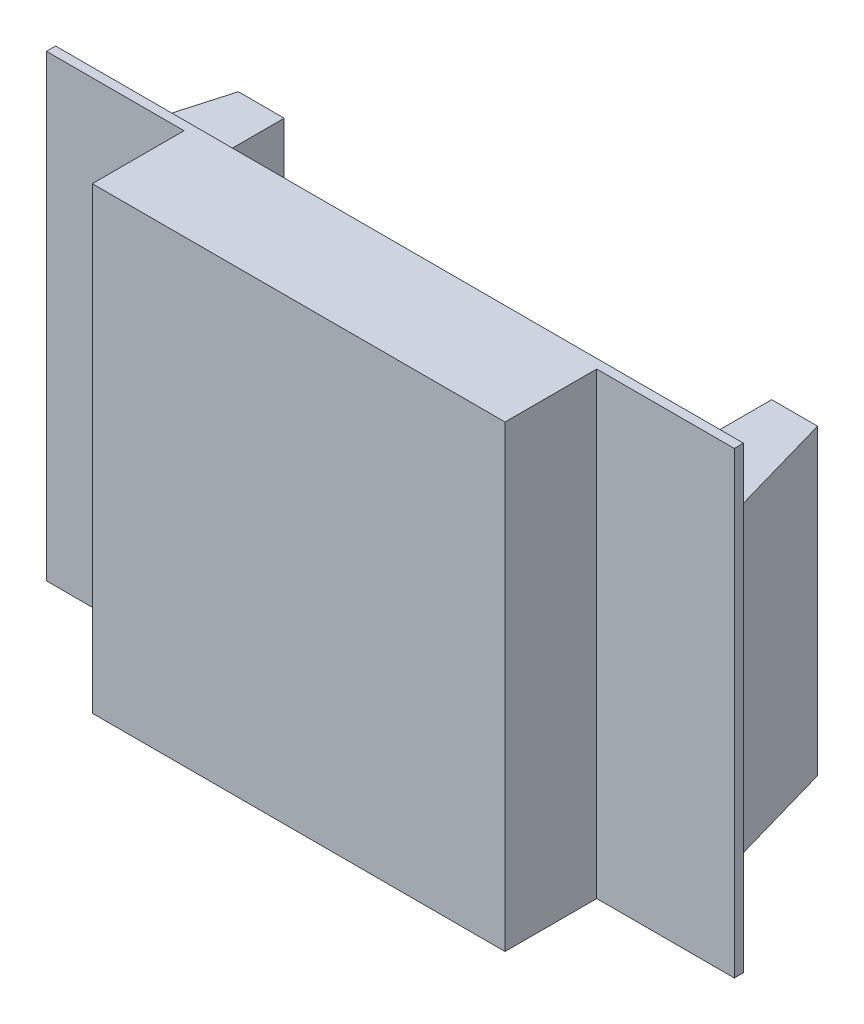
ISO-10303-21;
HEADER;
FILE_DESCRIPTION(('STEP AP214'),'2;1');
FILE_NAME('part.step','',(''),(''),'','','');
FILE_SCHEMA(('AUTOMOTIVE_DESIGN { 1 0 10303 214 1 1 1 1 }'));
ENDSEC;
DATA;
#1=APPLICATION_CONTEXT('core data for automotive mechanical design processes');
#2=APPLICATION_PROTOCOL_DEFINITION('international standard','automotive_design',2000,#1);
#3=PRODUCT_CONTEXT('',#1,'mechanical');
#4=PRODUCT('Part','Part','',(#3));
#5=PRODUCT_RELATED_PRODUCT_CATEGORY('part','',(#4));
#6=PRODUCT_DEFINITION_FORMATION('','',#4);
#7=PRODUCT_DEFINITION_CONTEXT('part definition',#1,'design');
#8=PRODUCT_DEFINITION('design','',#6,#7);
#9=PRODUCT_DEFINITION_SHAPE('','',#8);
#10=(LENGTH_UNIT() NAMED_UNIT(*) SI_UNIT(.MILLI.,.METRE.));
#11=(NAMED_UNIT(*) PLANE_ANGLE_UNIT() SI_UNIT($,.RADIAN.));
#12=(NAMED_UNIT(*) SI_UNIT($,.STERADIAN.) SOLID_ANGLE_UNIT());
#13=UNCERTAINTY_MEASURE_WITH_UNIT(LENGTH_MEASURE(1.E-05),#10,'distance_accuracy_value','');
#14=(GEOMETRIC_REPRESENTATION_CONTEXT(3) GLOBAL_UNCERTAINTY_ASSIGNED_CONTEXT((#13)) GLOBAL_UNIT_ASSIGNED_CONTEXT((#10,
#11,#12)) REPRESENTATION_CONTEXT('',''));
#15=CARTESIAN_POINT('',(0.,0.,0.));
#16=DIRECTION('',(0.,0.,1.));
#17=DIRECTION('',(1.,0.,0.));
#18=AXIS2_PLACEMENT_3D('',#15,#16,#17);
#19=CARTESIAN_POINT('',(0.,0.,1.));
#20=DIRECTION('',(0.,0.,1.));
#21=DIRECTION('',(1.,0.,0.));
#22=AXIS2_PLACEMENT_3D('',#19,#20,#21);
#23=PLANE('',#22);
#24=DIRECTION('',(-1.,0.,0.));
#25=VECTOR('',#24,1.);
#26=CARTESIAN_POINT('',(-42.4202127659574,41.3563829787234,1.));
#27=LINE('',#26,#25);
#28=CARTESIAN_POINT('',(32.5797872340425,41.3563829787234,1.));
#29=VERTEX_POINT('',#28);
#30=CARTESIAN_POINT('',(17.5797872340425,41.3563829787234,1.));
#31=VERTEX_POINT('',#30);
#32=EDGE_CURVE('E248',#29,#31,#27,.T.);
#33=ORIENTED_EDGE('',*,*,#32,.T.);
#34=DIRECTION('',(0.,-1.,0.));
#35=VECTOR('',#34,1.);
#36=CARTESIAN_POINT('',(17.5797872340425,87.4541052651878,1.));
#37=LINE('',#36,#35);
#38=CARTESIAN_POINT('',(17.5797872340425,-8.6436170212766,1.));
#39=VERTEX_POINT('',#38);
#40=EDGE_CURVE('E231',#31,#39,#37,.T.);
#41=ORIENTED_EDGE('',*,*,#40,.T.);
#42=DIRECTION('',(1.,0.,0.));
#43=VECTOR('',#42,1.);
#44=CARTESIAN_POINT('',(-42.4202127659574,-8.6436170212766,1.));
#45=LINE('',#44,#43);
#46=CARTESIAN_POINT('',(32.5797872340426,-8.6436170212766,1.));
#47=VERTEX_POINT('',#46);
#48=EDGE_CURVE('E240',#39,#47,#45,.T.);
#49=ORIENTED_EDGE('',*,*,#48,.T.);
#50=DIRECTION('',(0.,1.,0.));
#51=VECTOR('',#50,1.);
#52=CARTESIAN_POINT('',(32.5797872340425,41.3563829787234,1.));
#53=LINE('',#52,#51);
#54=EDGE_CURVE('E245',#47,#29,#53,.T.);
#55=ORIENTED_EDGE('',*,*,#54,.T.);
#56=EDGE_LOOP('',(#33,#41,#49,#55));
#57=FACE_BOUND('',#56,.T.);
#58=ADVANCED_FACE('F34',(#57),#23,.T.);
#59=CARTESIAN_POINT('',(-42.4202127659574,41.3563829787234,1.));
#60=DIRECTION('',(1.,0.,0.));
#61=DIRECTION('',(0.,0.,-1.));
#62=AXIS2_PLACEMENT_3D('',#59,#60,#61);
#63=PLANE('',#62);
#64=DIRECTION('',(0.,-1.,0.));
#65=VECTOR('',#64,1.);
#66=CARTESIAN_POINT('',(-42.4202127659574,41.3563829787234,0.));
#67=LINE('',#66,#65);
#68=CARTESIAN_POINT('',(-42.4202127659574,41.3563829787234,0.));
#69=VERTEX_POINT('',#68);
#70=CARTESIAN_POINT('',(-42.4202127659574,-8.6436170212766,0.));
#71=VERTEX_POINT('',#70);
#72=EDGE_CURVE('E229',#69,#71,#67,.T.);
#73=ORIENTED_EDGE('',*,*,#72,.T.);
#74=DIRECTION('',(0.,0.,-1.));
#75=VECTOR('',#74,1.);
#76=CARTESIAN_POINT('',(-42.4202127659574,-8.6436170212766,1.));
#77=LINE('',#76,#75);
#78=CARTESIAN_POINT('',(-42.4202127659574,-8.6436170212766,1.));
#79=VERTEX_POINT('',#78);
#80=EDGE_CURVE('E11',#79,#71,#77,.T.);
#81=ORIENTED_EDGE('',*,*,#80,.F.);
#82=DIRECTION('',(0.,-1.,0.));
#83=VECTOR('',#82,1.);
#84=CARTESIAN_POINT('',(-42.4202127659574,41.3563829787234,1.));
#85=LINE('',#84,#83);
#86=CARTESIAN_POINT('',(-42.4202127659574,41.3563829787234,1.));
#87=VERTEX_POINT('',#86);
#88=EDGE_CURVE('E237',#87,#79,#85,.T.);
#89=ORIENTED_EDGE('',*,*,#88,.F.);
#90=DIRECTION('',(0.,0.,-1.));
#91=VECTOR('',#90,1.);
#92=CARTESIAN_POINT('',(-42.4202127659574,41.3563829787234,1.));
#93=LINE('',#92,#91);
#94=EDGE_CURVE('E251',#87,#69,#93,.T.);
#95=ORIENTED_EDGE('',*,*,#94,.T.);
#96=EDGE_LOOP('',(#73,#81,#89,#95));
#97=FACE_BOUND('',#96,.T.);
#98=ADVANCED_FACE('F36',(#97),#63,.F.);
#99=CARTESIAN_POINT('',(-42.4202127659574,-8.6436170212766,1.));
#100=DIRECTION('',(0.,1.,0.));
#101=DIRECTION('',(0.,0.,1.));
#102=AXIS2_PLACEMENT_3D('',#99,#100,#101);
#103=PLANE('',#102);
#104=DIRECTION('',(1.,0.,0.));
#105=VECTOR('',#104,1.);
#106=CARTESIAN_POINT('',(-42.4202127659574,-8.6436170212766,0.));
#107=LINE('',#106,#105);
#108=CARTESIAN_POINT('',(32.5797872340426,-8.6436170212766,0.));
#109=VERTEX_POINT('',#108);
#110=EDGE_CURVE('E254',#71,#109,#107,.T.);
#111=ORIENTED_EDGE('',*,*,#110,.T.);
#112=DIRECTION('',(0.,0.,-1.));
#113=VECTOR('',#112,1.);
#114=CARTESIAN_POINT('',(32.5797872340426,-8.6436170212766,1.));
#115=LINE('',#114,#113);
#116=EDGE_CURVE('E42',#47,#109,#115,.T.);
#117=ORIENTED_EDGE('',*,*,#116,.F.);
#118=ORIENTED_EDGE('',*,*,#48,.F.);
#119=DIRECTION('',(0.,0.,1.));
#120=VECTOR('',#119,1.);
#121=CARTESIAN_POINT('',(17.5797872340425,-8.6436170212766,1.));
#122=LINE('',#121,#120);
#123=CARTESIAN_POINT('',(17.5797872340425,-8.6436170212766,11.));
#124=VERTEX_POINT('',#123);
#125=EDGE_CURVE('E210',#39,#124,#122,.T.);
#126=ORIENTED_EDGE('',*,*,#125,.T.);
#127=DIRECTION('',(-1.,0.,0.));
#128=VECTOR('',#127,1.);
#129=CARTESIAN_POINT('',(-27.4202127659574,-8.6436170212766,11.));
#130=LINE('',#129,#128);
#131=CARTESIAN_POINT('',(-27.4202127659574,-8.6436170212766,11.));
#132=VERTEX_POINT('',#131);
#133=EDGE_CURVE('E216',#124,#132,#130,.T.);
#134=ORIENTED_EDGE('',*,*,#133,.T.);
#135=DIRECTION('',(0.,0.,-1.));
#136=VECTOR('',#135,1.);
#137=CARTESIAN_POINT('',(-27.4202127659574,-8.6436170212766,1.));
#138=LINE('',#137,#136);
#139=CARTESIAN_POINT('',(-27.4202127659574,-8.6436170212766,1.));
#140=VERTEX_POINT('',#139);
#141=EDGE_CURVE('E213',#132,#140,#138,.T.);
#142=ORIENTED_EDGE('',*,*,#141,.T.);
#143=EDGE_CURVE('E242',#79,#140,#45,.T.);
#144=ORIENTED_EDGE('',*,*,#143,.F.);
#145=ORIENTED_EDGE('',*,*,#80,.T.);
#146=EDGE_LOOP('',(#111,#117,#118,#126,#134,#142,#144,#145));
#147=FACE_BOUND('',#146,.T.);
#148=ADVANCED_FACE('F299',(#147),#103,.F.);
#149=CARTESIAN_POINT('',(32.5797872340425,41.3563829787234,1.));
#150=DIRECTION('',(-1.,0.,0.));
#151=DIRECTION('',(0.,-1.,0.));
#152=AXIS2_PLACEMENT_3D('',#149,#150,#151);
#153=PLANE('',#152);
#154=DIRECTION('',(0.,1.,0.));
#155=VECTOR('',#154,1.);
#156=CARTESIAN_POINT('',(32.5797872340425,41.3563829787234,0.));
#157=LINE('',#156,#155);
#158=CARTESIAN_POINT('',(32.5797872340425,41.3563829787234,0.));
#159=VERTEX_POINT('',#158);
#160=EDGE_CURVE('E256',#109,#159,#157,.T.);
#161=ORIENTED_EDGE('',*,*,#160,.T.);
#162=DIRECTION('',(0.,0.,-1.));
#163=VECTOR('',#162,1.);
#164=CARTESIAN_POINT('',(32.5797872340425,41.3563829787234,1.));
#165=LINE('',#164,#163);
#166=EDGE_CURVE('E261',#29,#159,#165,.T.);
#167=ORIENTED_EDGE('',*,*,#166,.F.);
#168=ORIENTED_EDGE('',*,*,#54,.F.);
#169=ORIENTED_EDGE('',*,*,#116,.T.);
#170=EDGE_LOOP('',(#161,#167,#168,#169));
#171=FACE_BOUND('',#170,.T.);
#172=ADVANCED_FACE('F268',(#171),#153,.F.);
#173=CARTESIAN_POINT('',(-42.4202127659574,41.3563829787234,1.));
#174=DIRECTION('',(0.,-1.,0.));
#175=DIRECTION('',(0.,0.,-1.));
#176=AXIS2_PLACEMENT_3D('',#173,#174,#175);
#177=PLANE('',#176);
#178=DIRECTION('',(-1.,0.,0.));
#179=VECTOR('',#178,1.);
#180=CARTESIAN_POINT('',(-42.4202127659574,41.3563829787234,0.));
#181=LINE('',#180,#179);
#182=EDGE_CURVE('E241',#159,#69,#181,.T.);
#183=ORIENTED_EDGE('',*,*,#182,.T.);
#184=ORIENTED_EDGE('',*,*,#94,.F.);
#185=CARTESIAN_POINT('',(-27.4202127659574,41.3563829787234,1.));
#186=VERTEX_POINT('',#185);
#187=EDGE_CURVE('E247',#186,#87,#27,.T.);
#188=ORIENTED_EDGE('',*,*,#187,.F.);
#189=DIRECTION('',(0.,0.,-1.));
#190=VECTOR('',#189,1.);
#191=CARTESIAN_POINT('',(-27.4202127659574,41.3563829787234,1.));
#192=LINE('',#191,#190);
#193=CARTESIAN_POINT('',(-27.4202127659574,41.3563829787234,11.));
#194=VERTEX_POINT('',#193);
#195=EDGE_CURVE('E227',#194,#186,#192,.T.);
#196=ORIENTED_EDGE('',*,*,#195,.F.);
#197=DIRECTION('',(-1.,0.,0.));
#198=VECTOR('',#197,1.);
#199=CARTESIAN_POINT('',(-27.4202127659574,41.3563829787234,11.));
#200=LINE('',#199,#198);
#201=CARTESIAN_POINT('',(17.5797872340425,41.3563829787234,11.));
#202=VERTEX_POINT('',#201);
#203=EDGE_CURVE('E223',#202,#194,#200,.T.);
#204=ORIENTED_EDGE('',*,*,#203,.F.);
#205=DIRECTION('',(0.,0.,1.));
#206=VECTOR('',#205,1.);
#207=CARTESIAN_POINT('',(17.5797872340425,41.3563829787234,1.));
#208=LINE('',#207,#206);
#209=EDGE_CURVE('E220',#31,#202,#208,.T.);
#210=ORIENTED_EDGE('',*,*,#209,.F.);
#211=ORIENTED_EDGE('',*,*,#32,.F.);
#212=ORIENTED_EDGE('',*,*,#166,.T.);
#213=EDGE_LOOP('',(#183,#184,#188,#196,#204,#210,#211,#212));
#214=FACE_BOUND('',#213,.T.);
#215=ADVANCED_FACE('F278',(#214),#177,.F.);
#216=DIRECTION('',(0.,-1.,0.));
#217=VECTOR('',#216,1.);
#218=CARTESIAN_POINT('',(-27.4202127659574,87.4541052651878,1.));
#219=LINE('',#218,#217);
#220=EDGE_CURVE('E219',#186,#140,#219,.T.);
#221=ORIENTED_EDGE('',*,*,#220,.F.);
#222=ORIENTED_EDGE('',*,*,#187,.T.);
#223=ORIENTED_EDGE('',*,*,#88,.T.);
#224=ORIENTED_EDGE('',*,*,#143,.T.);
#225=EDGE_LOOP('',(#221,#222,#223,#224));
#226=FACE_BOUND('',#225,.T.);
#227=ADVANCED_FACE('F286',(#226),#23,.T.);
#228=CARTESIAN_POINT('',(0.,0.,0.));
#229=DIRECTION('',(0.,0.,1.));
#230=DIRECTION('',(1.,0.,0.));
#231=AXIS2_PLACEMENT_3D('',#228,#229,#230);
#232=PLANE('',#231);
#233=DIRECTION('',(0.,-1.,0.));
#234=VECTOR('',#233,1.);
#235=CARTESIAN_POINT('',(30.6560744380778,33.,0.));
#236=LINE('',#235,#234);
#237=CARTESIAN_POINT('',(30.6560744380778,33.,0.));
#238=VERTEX_POINT('',#237);
#239=CARTESIAN_POINT('',(30.6560744380778,0.,0.));
#240=VERTEX_POINT('',#239);
#241=EDGE_CURVE('E54',#238,#240,#236,.T.);
#242=ORIENTED_EDGE('',*,*,#241,.F.);
#243=DIRECTION('',(1.,0.,0.));
#244=VECTOR('',#243,1.);
#245=CARTESIAN_POINT('',(21.6560744380778,33.,0.));
#246=LINE('',#245,#244);
#247=CARTESIAN_POINT('',(21.6560744380778,33.,0.));
#248=VERTEX_POINT('',#247);
#249=EDGE_CURVE('E49',#248,#238,#246,.T.);
#250=ORIENTED_EDGE('',*,*,#249,.F.);
#251=DIRECTION('',(0.,-1.,0.));
#252=VECTOR('',#251,1.);
#253=CARTESIAN_POINT('',(21.6560744380778,33.,0.));
#254=LINE('',#253,#252);
#255=CARTESIAN_POINT('',(21.6560744380778,0.,0.));
#256=VERTEX_POINT('',#255);
#257=EDGE_CURVE('E178',#248,#256,#254,.T.);
#258=ORIENTED_EDGE('',*,*,#257,.T.);
#259=DIRECTION('',(1.,0.,0.));
#260=VECTOR('',#259,1.);
#261=CARTESIAN_POINT('',(21.6560744380778,0.,0.));
#262=LINE('',#261,#260);
#263=EDGE_CURVE('E171',#256,#240,#262,.T.);
#264=ORIENTED_EDGE('',*,*,#263,.T.);
#265=EDGE_LOOP('',(#242,#250,#258,#264));
#266=FACE_BOUND('',#265,.T.);
#267=DIRECTION('',(0.,-1.,0.));
#268=VECTOR('',#267,1.);
#269=CARTESIAN_POINT('',(-31.4964999699927,33.,0.));
#270=LINE('',#269,#268);
#271=CARTESIAN_POINT('',(-31.4964999699927,33.,0.));
#272=VERTEX_POINT('',#271);
#273=CARTESIAN_POINT('',(-31.4964999699927,0.,0.));
#274=VERTEX_POINT('',#273);
#275=EDGE_CURVE('E207',#272,#274,#270,.T.);
#276=ORIENTED_EDGE('',*,*,#275,.F.);
#277=DIRECTION('',(1.,0.,0.));
#278=VECTOR('',#277,1.);
#279=CARTESIAN_POINT('',(-31.4964999699927,33.,0.));
#280=LINE('',#279,#278);
#281=CARTESIAN_POINT('',(-40.4964999699927,33.,0.));
#282=VERTEX_POINT('',#281);
#283=EDGE_CURVE('E181',#282,#272,#280,.T.);
#284=ORIENTED_EDGE('',*,*,#283,.F.);
#285=DIRECTION('',(0.,-1.,0.));
#286=VECTOR('',#285,1.);
#287=CARTESIAN_POINT('',(-40.4964999699927,33.,0.));
#288=LINE('',#287,#286);
#289=CARTESIAN_POINT('',(-40.4964999699927,0.,0.));
#290=VERTEX_POINT('',#289);
#291=EDGE_CURVE('E192',#282,#290,#288,.T.);
#292=ORIENTED_EDGE('',*,*,#291,.T.);
#293=DIRECTION('',(1.,0.,0.));
#294=VECTOR('',#293,1.);
#295=CARTESIAN_POINT('',(-31.4964999699927,0.,0.));
#296=LINE('',#295,#294);
#297=EDGE_CURVE('E180',#290,#274,#296,.T.);
#298=ORIENTED_EDGE('',*,*,#297,.T.);
#299=EDGE_LOOP('',(#276,#284,#292,#298));
#300=FACE_BOUND('',#299,.T.);
#301=ORIENTED_EDGE('',*,*,#72,.F.);
#302=ORIENTED_EDGE('',*,*,#182,.F.);
#303=ORIENTED_EDGE('',*,*,#160,.F.);
#304=ORIENTED_EDGE('',*,*,#110,.F.);
#305=EDGE_LOOP('',(#301,#302,#303,#304));
#306=FACE_BOUND('',#305,.T.);
#307=ADVANCED_FACE('F275',(#266,#300,#306),#232,.F.);
#308=CARTESIAN_POINT('',(17.5797872340425,87.4541052651878,1.));
#309=DIRECTION('',(-1.,0.,0.));
#310=DIRECTION('',(0.,0.,1.));
#311=AXIS2_PLACEMENT_3D('',#308,#309,#310);
#312=PLANE('',#311);
#313=ORIENTED_EDGE('',*,*,#40,.F.);
#314=ORIENTED_EDGE('',*,*,#209,.T.);
#315=DIRECTION('',(0.,-1.,0.));
#316=VECTOR('',#315,1.);
#317=CARTESIAN_POINT('',(17.5797872340425,87.4541052651878,11.));
#318=LINE('',#317,#316);
#319=EDGE_CURVE('E234',#202,#124,#318,.T.);
#320=ORIENTED_EDGE('',*,*,#319,.T.);
#321=ORIENTED_EDGE('',*,*,#125,.F.);
#322=EDGE_LOOP('',(#313,#314,#320,#321));
#323=FACE_BOUND('',#322,.T.);
#324=ADVANCED_FACE('F297',(#323),#312,.F.);
#325=CARTESIAN_POINT('',(-27.4202127659574,87.4541052651878,11.));
#326=DIRECTION('',(0.,0.,-1.));
#327=DIRECTION('',(-1.,0.,0.));
#328=AXIS2_PLACEMENT_3D('',#325,#326,#327);
#329=PLANE('',#328);
#330=ORIENTED_EDGE('',*,*,#319,.F.);
#331=ORIENTED_EDGE('',*,*,#203,.T.);
#332=DIRECTION('',(0.,-1.,0.));
#333=VECTOR('',#332,1.);
#334=CARTESIAN_POINT('',(-27.4202127659574,87.4541052651878,11.));
#335=LINE('',#334,#333);
#336=EDGE_CURVE('E224',#194,#132,#335,.T.);
#337=ORIENTED_EDGE('',*,*,#336,.T.);
#338=ORIENTED_EDGE('',*,*,#133,.F.);
#339=EDGE_LOOP('',(#330,#331,#337,#338));
#340=FACE_BOUND('',#339,.T.);
#341=ADVANCED_FACE('F294',(#340),#329,.F.);
#342=CARTESIAN_POINT('',(-27.4202127659574,87.4541052651878,1.));
#343=DIRECTION('',(1.,0.,0.));
#344=DIRECTION('',(0.,0.,-1.));
#345=AXIS2_PLACEMENT_3D('',#342,#343,#344);
#346=PLANE('',#345);
#347=ORIENTED_EDGE('',*,*,#336,.F.);
#348=ORIENTED_EDGE('',*,*,#195,.T.);
#349=ORIENTED_EDGE('',*,*,#220,.T.);
#350=ORIENTED_EDGE('',*,*,#141,.F.);
#351=EDGE_LOOP('',(#347,#348,#349,#350));
#352=FACE_BOUND('',#351,.T.);
#353=ADVANCED_FACE('F291',(#352),#346,.F.);
#354=CARTESIAN_POINT('',(-31.4964999699927,33.,-14.));
#355=DIRECTION('',(-1.,0.,0.));
#356=DIRECTION('',(0.,0.,1.));
#357=AXIS2_PLACEMENT_3D('',#354,#355,#356);
#358=PLANE('',#357);
#359=DIRECTION('',(0.,0.,-1.));
#360=VECTOR('',#359,1.);
#361=CARTESIAN_POINT('',(-31.4964999699927,0.,-14.));
#362=LINE('',#361,#360);
#363=CARTESIAN_POINT('',(-31.4964999699927,0.,-14.));
#364=VERTEX_POINT('',#363);
#365=EDGE_CURVE('E194',#274,#364,#362,.T.);
#366=ORIENTED_EDGE('',*,*,#365,.T.);
#367=DIRECTION('',(0.,-1.,0.));
#368=VECTOR('',#367,1.);
#369=CARTESIAN_POINT('',(-31.4964999699927,33.,-14.));
#370=LINE('',#369,#368);
#371=CARTESIAN_POINT('',(-31.4964999699927,33.,-14.));
#372=VERTEX_POINT('',#371);
#373=EDGE_CURVE('E204',#372,#364,#370,.T.);
#374=ORIENTED_EDGE('',*,*,#373,.F.);
#375=DIRECTION('',(0.,0.,-1.));
#376=VECTOR('',#375,1.);
#377=CARTESIAN_POINT('',(-31.4964999699927,33.,-14.));
#378=LINE('',#377,#376);
#379=EDGE_CURVE('E184',#272,#372,#378,.T.);
#380=ORIENTED_EDGE('',*,*,#379,.F.);
#381=ORIENTED_EDGE('',*,*,#275,.T.);
#382=EDGE_LOOP('',(#366,#374,#380,#381));
#383=FACE_BOUND('',#382,.T.);
#384=ADVANCED_FACE('F379',(#383),#358,.F.);
#385=CARTESIAN_POINT('',(-36.4964999699927,33.,-14.));
#386=DIRECTION('',(0.,0.,1.));
#387=DIRECTION('',(1.,0.,0.));
#388=AXIS2_PLACEMENT_3D('',#385,#386,#387);
#389=PLANE('',#388);
#390=DIRECTION('',(-1.,0.,0.));
#391=VECTOR('',#390,1.);
#392=CARTESIAN_POINT('',(-36.4964999699927,0.,-14.));
#393=LINE('',#392,#391);
#394=CARTESIAN_POINT('',(-36.4964999699927,0.,-14.));
#395=VERTEX_POINT('',#394);
#396=EDGE_CURVE('E196',#364,#395,#393,.T.);
#397=ORIENTED_EDGE('',*,*,#396,.T.);
#398=DIRECTION('',(0.,-1.,0.));
#399=VECTOR('',#398,1.);
#400=CARTESIAN_POINT('',(-36.4964999699927,33.,-14.));
#401=LINE('',#400,#399);
#402=CARTESIAN_POINT('',(-36.4964999699927,33.,-14.));
#403=VERTEX_POINT('',#402);
#404=EDGE_CURVE('E201',#403,#395,#401,.T.);
#405=ORIENTED_EDGE('',*,*,#404,.F.);
#406=DIRECTION('',(-1.,0.,0.));
#407=VECTOR('',#406,1.);
#408=CARTESIAN_POINT('',(-36.4964999699927,33.,-14.));
#409=LINE('',#408,#407);
#410=EDGE_CURVE('E187',#372,#403,#409,.T.);
#411=ORIENTED_EDGE('',*,*,#410,.F.);
#412=ORIENTED_EDGE('',*,*,#373,.T.);
#413=EDGE_LOOP('',(#397,#405,#411,#412));
#414=FACE_BOUND('',#413,.T.);
#415=ADVANCED_FACE('F387',(#414),#389,.F.);
#416=CARTESIAN_POINT('',(-40.4964999699927,33.,0.));
#417=DIRECTION('',(0.961523947640823,0.,0.274721127897378));
#418=DIRECTION('',(0.274721127897378,0.,-0.961523947640823));
#419=AXIS2_PLACEMENT_3D('',#416,#417,#418);
#420=PLANE('',#419);
#421=DIRECTION('',(-0.274721127897378,0.,0.961523947640823));
#422=VECTOR('',#421,1.);
#423=CARTESIAN_POINT('',(-40.4964999699927,0.,0.));
#424=LINE('',#423,#422);
#425=EDGE_CURVE('E185',#395,#290,#424,.T.);
#426=ORIENTED_EDGE('',*,*,#425,.T.);
#427=ORIENTED_EDGE('',*,*,#291,.F.);
#428=DIRECTION('',(-0.274721127897378,0.,0.961523947640823));
#429=VECTOR('',#428,1.);
#430=CARTESIAN_POINT('',(-40.4964999699927,33.,0.));
#431=LINE('',#430,#429);
#432=EDGE_CURVE('E189',#403,#282,#431,.T.);
#433=ORIENTED_EDGE('',*,*,#432,.F.);
#434=ORIENTED_EDGE('',*,*,#404,.T.);
#435=EDGE_LOOP('',(#426,#427,#433,#434));
#436=FACE_BOUND('',#435,.T.);
#437=ADVANCED_FACE('F394',(#436),#420,.F.);
#438=CARTESIAN_POINT('',(0.,33.,0.));
#439=DIRECTION('',(0.,1.,0.));
#440=DIRECTION('',(0.,0.,1.));
#441=AXIS2_PLACEMENT_3D('',#438,#439,#440);
#442=PLANE('',#441);
#443=ORIENTED_EDGE('',*,*,#283,.T.);
#444=ORIENTED_EDGE('',*,*,#379,.T.);
#445=ORIENTED_EDGE('',*,*,#410,.T.);
#446=ORIENTED_EDGE('',*,*,#432,.T.);
#447=EDGE_LOOP('',(#443,#444,#445,#446));
#448=FACE_BOUND('',#447,.T.);
#449=ADVANCED_FACE('F402',(#448),#442,.T.);
#450=CARTESIAN_POINT('',(0.,0.,0.));
#451=DIRECTION('',(0.,1.,0.));
#452=DIRECTION('',(0.,0.,1.));
#453=AXIS2_PLACEMENT_3D('',#450,#451,#452);
#454=PLANE('',#453);
#455=ORIENTED_EDGE('',*,*,#297,.F.);
#456=ORIENTED_EDGE('',*,*,#425,.F.);
#457=ORIENTED_EDGE('',*,*,#396,.F.);
#458=ORIENTED_EDGE('',*,*,#365,.F.);
#459=EDGE_LOOP('',(#455,#456,#457,#458));
#460=FACE_BOUND('',#459,.T.);
#461=ADVANCED_FACE('F410',(#460),#454,.F.);
#462=CARTESIAN_POINT('',(21.6560744380778,33.,-14.));
#463=DIRECTION('',(1.,0.,0.));
#464=DIRECTION('',(0.,0.,-1.));
#465=AXIS2_PLACEMENT_3D('',#462,#463,#464);
#466=PLANE('',#465);
#467=DIRECTION('',(0.,0.,1.));
#468=VECTOR('',#467,1.);
#469=CARTESIAN_POINT('',(21.6560744380778,0.,-14.));
#470=LINE('',#469,#468);
#471=CARTESIAN_POINT('',(21.6560744380778,0.,-14.));
#472=VERTEX_POINT('',#471);
#473=EDGE_CURVE('E168',#472,#256,#470,.T.);
#474=ORIENTED_EDGE('',*,*,#473,.T.);
#475=ORIENTED_EDGE('',*,*,#257,.F.);
#476=DIRECTION('',(0.,0.,1.));
#477=VECTOR('',#476,1.);
#478=CARTESIAN_POINT('',(21.6560744380778,33.,-14.));
#479=LINE('',#478,#477);
#480=CARTESIAN_POINT('',(21.6560744380778,33.,-14.));
#481=VERTEX_POINT('',#480);
#482=EDGE_CURVE('E175',#481,#248,#479,.T.);
#483=ORIENTED_EDGE('',*,*,#482,.F.);
#484=DIRECTION('',(0.,-1.,0.));
#485=VECTOR('',#484,1.);
#486=CARTESIAN_POINT('',(21.6560744380778,33.,-14.));
#487=LINE('',#486,#485);
#488=EDGE_CURVE('E159',#481,#472,#487,.T.);
#489=ORIENTED_EDGE('',*,*,#488,.T.);
#490=EDGE_LOOP('',(#474,#475,#483,#489));
#491=FACE_BOUND('',#490,.T.);
#492=ADVANCED_FACE('F418',(#491),#466,.F.);
#493=CARTESIAN_POINT('',(30.6560744380778,33.,0.));
#494=DIRECTION('',(-0.961523947640823,0.,0.274721127897378));
#495=DIRECTION('',(0.274721127897378,0.,0.961523947640823));
#496=AXIS2_PLACEMENT_3D('',#493,#494,#495);
#497=PLANE('',#496);
#498=DIRECTION('',(-0.274721127897378,0.,-0.961523947640823));
#499=VECTOR('',#498,1.);
#500=CARTESIAN_POINT('',(30.6560744380778,0.,0.));
#501=LINE('',#500,#499);
#502=CARTESIAN_POINT('',(26.6560744380778,0.,-14.));
#503=VERTEX_POINT('',#502);
#504=EDGE_CURVE('E156',#240,#503,#501,.T.);
#505=ORIENTED_EDGE('',*,*,#504,.T.);
#506=DIRECTION('',(0.,-1.,0.));
#507=VECTOR('',#506,1.);
#508=CARTESIAN_POINT('',(26.6560744380778,33.,-14.));
#509=LINE('',#508,#507);
#510=CARTESIAN_POINT('',(26.6560744380778,33.,-14.));
#511=VERTEX_POINT('',#510);
#512=EDGE_CURVE('E153',#511,#503,#509,.T.);
#513=ORIENTED_EDGE('',*,*,#512,.F.);
#514=DIRECTION('',(-0.274721127897378,0.,-0.961523947640823));
#515=VECTOR('',#514,1.);
#516=CARTESIAN_POINT('',(30.6560744380778,33.,0.));
#517=LINE('',#516,#515);
#518=EDGE_CURVE('E144',#238,#511,#517,.T.);
#519=ORIENTED_EDGE('',*,*,#518,.F.);
#520=ORIENTED_EDGE('',*,*,#241,.T.);
#521=EDGE_LOOP('',(#505,#513,#519,#520));
#522=FACE_BOUND('',#521,.T.);
#523=ADVANCED_FACE('F154',(#522),#497,.F.);
#524=CARTESIAN_POINT('',(26.6560744380778,33.,-14.));
#525=DIRECTION('',(0.,0.,1.));
#526=DIRECTION('',(1.,0.,0.));
#527=AXIS2_PLACEMENT_3D('',#524,#525,#526);
#528=PLANE('',#527);
#529=DIRECTION('',(-1.,0.,0.));
#530=VECTOR('',#529,1.);
#531=CARTESIAN_POINT('',(26.6560744380778,0.,-14.));
#532=LINE('',#531,#530);
#533=EDGE_CURVE('E174',#503,#472,#532,.T.);
#534=ORIENTED_EDGE('',*,*,#533,.T.);
#535=ORIENTED_EDGE('',*,*,#488,.F.);
#536=DIRECTION('',(-1.,0.,0.));
#537=VECTOR('',#536,1.);
#538=CARTESIAN_POINT('',(26.6560744380778,33.,-14.));
#539=LINE('',#538,#537);
#540=EDGE_CURVE('E148',#511,#481,#539,.T.);
#541=ORIENTED_EDGE('',*,*,#540,.F.);
#542=ORIENTED_EDGE('',*,*,#512,.T.);
#543=EDGE_LOOP('',(#534,#535,#541,#542));
#544=FACE_BOUND('',#543,.T.);
#545=ADVANCED_FACE('F161',(#544),#528,.F.);
#546=CARTESIAN_POINT('',(0.,33.,0.));
#547=DIRECTION('',(0.,1.,0.));
#548=DIRECTION('',(0.,0.,1.));
#549=AXIS2_PLACEMENT_3D('',#546,#547,#548);
#550=PLANE('',#549);
#551=ORIENTED_EDGE('',*,*,#482,.T.);
#552=ORIENTED_EDGE('',*,*,#249,.T.);
#553=ORIENTED_EDGE('',*,*,#518,.T.);
#554=ORIENTED_EDGE('',*,*,#540,.T.);
#555=EDGE_LOOP('',(#551,#552,#553,#554));
#556=FACE_BOUND('',#555,.T.);
#557=ADVANCED_FACE('F146',(#556),#550,.T.);
#558=CARTESIAN_POINT('',(0.,0.,0.));
#559=DIRECTION('',(0.,1.,0.));
#560=DIRECTION('',(0.,0.,1.));
#561=AXIS2_PLACEMENT_3D('',#558,#559,#560);
#562=PLANE('',#561);
#563=ORIENTED_EDGE('',*,*,#473,.F.);
#564=ORIENTED_EDGE('',*,*,#533,.F.);
#565=ORIENTED_EDGE('',*,*,#504,.F.);
#566=ORIENTED_EDGE('',*,*,#263,.F.);
#567=EDGE_LOOP('',(#563,#564,#565,#566));
#568=FACE_BOUND('',#567,.T.);
#569=ADVANCED_FACE('F445',(#568),#562,.F.);
#570=CLOSED_SHELL('',(#58,#98,#148,#172,#215,#227,#307,#324,#341,#353,#384,#415,#437,#449,#461,
#492,#523,#545,#557,#569));
#571=MANIFOLD_SOLID_BREP('B2',#570);
#572=ADVANCED_BREP_SHAPE_REPRESENTATION('',(#18,#571),#14);
#573=SHAPE_DEFINITION_REPRESENTATION(#9,#572);
ENDSEC;
END-ISO-10303-21;
